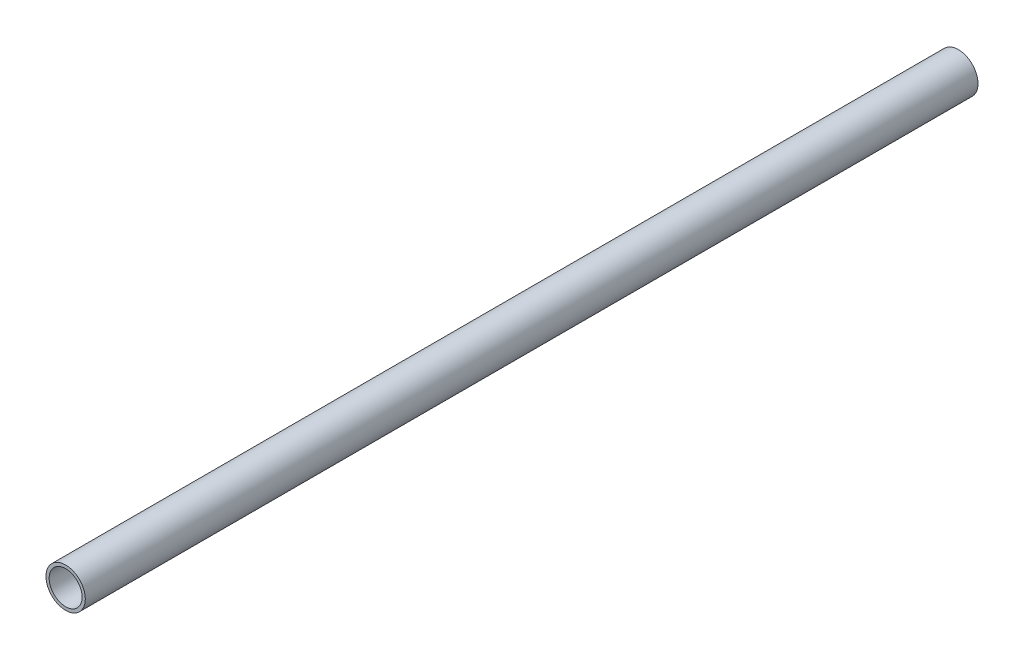
ISO-10303-21;
HEADER;
FILE_DESCRIPTION(('STEP AP214'),'2;1');
FILE_NAME('part.step','',(''),(''),'','','');
FILE_SCHEMA(('AUTOMOTIVE_DESIGN { 1 0 10303 214 1 1 1 1 }'));
ENDSEC;
DATA;
#1=APPLICATION_CONTEXT('core data for automotive mechanical design processes');
#2=APPLICATION_PROTOCOL_DEFINITION('international standard','automotive_design',2000,#1);
#3=PRODUCT_CONTEXT('',#1,'mechanical');
#4=PRODUCT('Part','Part','',(#3));
#5=PRODUCT_RELATED_PRODUCT_CATEGORY('part','',(#4));
#6=PRODUCT_DEFINITION_FORMATION('','',#4);
#7=PRODUCT_DEFINITION_CONTEXT('part definition',#1,'design');
#8=PRODUCT_DEFINITION('design','',#6,#7);
#9=PRODUCT_DEFINITION_SHAPE('','',#8);
#10=(LENGTH_UNIT() NAMED_UNIT(*) SI_UNIT(.MILLI.,.METRE.));
#11=(NAMED_UNIT(*) PLANE_ANGLE_UNIT() SI_UNIT($,.RADIAN.));
#12=(NAMED_UNIT(*) SI_UNIT($,.STERADIAN.) SOLID_ANGLE_UNIT());
#13=UNCERTAINTY_MEASURE_WITH_UNIT(LENGTH_MEASURE(1.E-05),#10,'distance_accuracy_value','');
#14=(GEOMETRIC_REPRESENTATION_CONTEXT(3) GLOBAL_UNCERTAINTY_ASSIGNED_CONTEXT((#13)) GLOBAL_UNIT_ASSIGNED_CONTEXT((#10,
#11,#12)) REPRESENTATION_CONTEXT('',''));
#15=CARTESIAN_POINT('',(0.,0.,0.));
#16=DIRECTION('',(0.,0.,1.));
#17=DIRECTION('',(1.,0.,0.));
#18=AXIS2_PLACEMENT_3D('',#15,#16,#17);
#19=CARTESIAN_POINT('',(0.,0.,-38.));
#20=DIRECTION('',(0.,0.,1.));
#21=DIRECTION('',(1.,0.,0.));
#22=AXIS2_PLACEMENT_3D('',#19,#20,#21);
#23=CYLINDRICAL_SURFACE('',#22,8.35);
#24=CARTESIAN_POINT('',(0.,0.,-38.));
#25=DIRECTION('',(0.,0.,1.));
#26=DIRECTION('',(1.,0.,0.));
#27=AXIS2_PLACEMENT_3D('',#24,#25,#26);
#28=CIRCLE('',#27,8.35);
#29=CARTESIAN_POINT('',(8.35,0.,-38.));
#30=VERTEX_POINT('',#29);
#31=EDGE_CURVE('E10',#30,#30,#28,.T.);
#32=ORIENTED_EDGE('',*,*,#31,.T.);
#33=EDGE_LOOP('',(#32));
#34=FACE_BOUND('',#33,.T.);
#35=CARTESIAN_POINT('',(0.,0.,341.));
#36=DIRECTION('',(0.,0.,1.));
#37=DIRECTION('',(1.,0.,0.));
#38=AXIS2_PLACEMENT_3D('',#35,#36,#37);
#39=CIRCLE('',#38,8.35);
#40=CARTESIAN_POINT('',(8.35,0.,341.));
#41=VERTEX_POINT('',#40);
#42=EDGE_CURVE('E42',#41,#41,#39,.T.);
#43=ORIENTED_EDGE('',*,*,#42,.F.);
#44=EDGE_LOOP('',(#43));
#45=FACE_BOUND('',#44,.T.);
#46=ADVANCED_FACE('F32',(#34,#45),#23,.T.);
#47=CARTESIAN_POINT('',(0.,0.,-38.));
#48=DIRECTION('',(0.,0.,1.));
#49=DIRECTION('',(1.,0.,0.));
#50=AXIS2_PLACEMENT_3D('',#47,#48,#49);
#51=PLANE('',#50);
#52=CARTESIAN_POINT('',(0.,0.,-38.));
#53=DIRECTION('',(0.,0.,1.));
#54=DIRECTION('',(1.,0.,0.));
#55=AXIS2_PLACEMENT_3D('',#52,#53,#54);
#56=CIRCLE('',#55,7.);
#57=CARTESIAN_POINT('',(7.,0.,-38.));
#58=VERTEX_POINT('',#57);
#59=EDGE_CURVE('E38',#58,#58,#56,.T.);
#60=ORIENTED_EDGE('',*,*,#59,.T.);
#61=EDGE_LOOP('',(#60));
#62=FACE_BOUND('',#61,.T.);
#63=ORIENTED_EDGE('',*,*,#31,.F.);
#64=EDGE_LOOP('',(#63));
#65=FACE_BOUND('',#64,.T.);
#66=ADVANCED_FACE('F61',(#62,#65),#51,.F.);
#67=CARTESIAN_POINT('',(0.,0.,-38.));
#68=DIRECTION('',(0.,0.,1.));
#69=DIRECTION('',(1.,0.,0.));
#70=AXIS2_PLACEMENT_3D('',#67,#68,#69);
#71=CYLINDRICAL_SURFACE('',#70,7.);
#72=ORIENTED_EDGE('',*,*,#59,.F.);
#73=EDGE_LOOP('',(#72));
#74=FACE_BOUND('',#73,.T.);
#75=CARTESIAN_POINT('',(0.,0.,341.));
#76=DIRECTION('',(0.,0.,1.));
#77=DIRECTION('',(1.,0.,0.));
#78=AXIS2_PLACEMENT_3D('',#75,#76,#77);
#79=CIRCLE('',#78,7.);
#80=CARTESIAN_POINT('',(7.,0.,341.));
#81=VERTEX_POINT('',#80);
#82=EDGE_CURVE('E46',#81,#81,#79,.T.);
#83=ORIENTED_EDGE('',*,*,#82,.T.);
#84=EDGE_LOOP('',(#83));
#85=FACE_BOUND('',#84,.T.);
#86=ADVANCED_FACE('F52',(#74,#85),#71,.F.);
#87=CARTESIAN_POINT('',(0.,0.,341.));
#88=DIRECTION('',(0.,0.,1.));
#89=DIRECTION('',(1.,0.,0.));
#90=AXIS2_PLACEMENT_3D('',#87,#88,#89);
#91=PLANE('',#90);
#92=ORIENTED_EDGE('',*,*,#42,.T.);
#93=EDGE_LOOP('',(#92));
#94=FACE_BOUND('',#93,.T.);
#95=ORIENTED_EDGE('',*,*,#82,.F.);
#96=EDGE_LOOP('',(#95));
#97=FACE_BOUND('',#96,.T.);
#98=ADVANCED_FACE('F54',(#94,#97),#91,.T.);
#99=CLOSED_SHELL('',(#46,#66,#86,#98));
#100=MANIFOLD_SOLID_BREP('B2',#99);
#101=ADVANCED_BREP_SHAPE_REPRESENTATION('',(#18,#100),#14);
#102=SHAPE_DEFINITION_REPRESENTATION(#9,#101);
ENDSEC;
END-ISO-10303-21;
